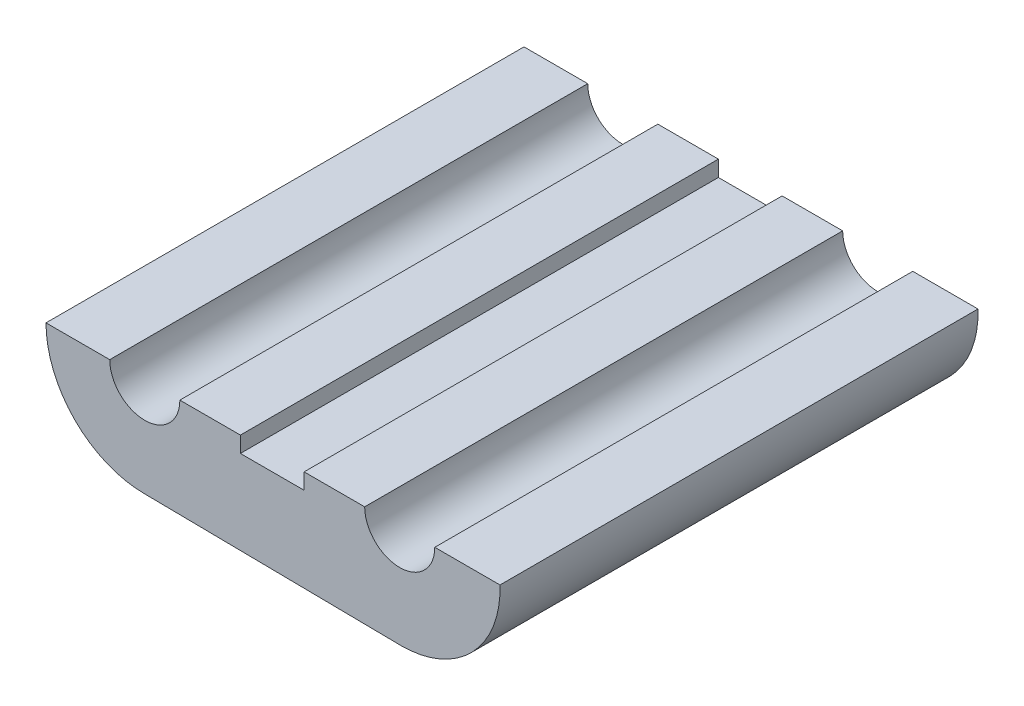
ISO-10303-21;
HEADER;
FILE_DESCRIPTION(('STEP AP214'),'2;1');
FILE_NAME('part.step','',(''),(''),'','','');
FILE_SCHEMA(('AUTOMOTIVE_DESIGN { 1 0 10303 214 1 1 1 1 }'));
ENDSEC;
DATA;
#1=APPLICATION_CONTEXT('core data for automotive mechanical design processes');
#2=APPLICATION_PROTOCOL_DEFINITION('international standard','automotive_design',2000,#1);
#3=PRODUCT_CONTEXT('',#1,'mechanical');
#4=PRODUCT('Part','Part','',(#3));
#5=PRODUCT_RELATED_PRODUCT_CATEGORY('part','',(#4));
#6=PRODUCT_DEFINITION_FORMATION('','',#4);
#7=PRODUCT_DEFINITION_CONTEXT('part definition',#1,'design');
#8=PRODUCT_DEFINITION('design','',#6,#7);
#9=PRODUCT_DEFINITION_SHAPE('','',#8);
#10=(LENGTH_UNIT() NAMED_UNIT(*) SI_UNIT(.MILLI.,.METRE.));
#11=(NAMED_UNIT(*) PLANE_ANGLE_UNIT() SI_UNIT($,.RADIAN.));
#12=(NAMED_UNIT(*) SI_UNIT($,.STERADIAN.) SOLID_ANGLE_UNIT());
#13=UNCERTAINTY_MEASURE_WITH_UNIT(LENGTH_MEASURE(1.E-05),#10,'distance_accuracy_value','');
#14=(GEOMETRIC_REPRESENTATION_CONTEXT(3) GLOBAL_UNCERTAINTY_ASSIGNED_CONTEXT((#13)) GLOBAL_UNIT_ASSIGNED_CONTEXT((#10,
#11,#12)) REPRESENTATION_CONTEXT('',''));
#15=CARTESIAN_POINT('',(0.,0.,0.));
#16=DIRECTION('',(0.,0.,1.));
#17=DIRECTION('',(1.,0.,0.));
#18=AXIS2_PLACEMENT_3D('',#15,#16,#17);
#19=CARTESIAN_POINT('',(0.,0.,0.));
#20=DIRECTION('',(0.,-1.,0.));
#21=DIRECTION('',(0.,0.,-1.));
#22=AXIS2_PLACEMENT_3D('',#19,#20,#21);
#23=PLANE('',#22);
#24=DIRECTION('',(1.,0.,0.));
#25=VECTOR('',#24,1.);
#26=CARTESIAN_POINT('',(0.,0.,0.));
#27=LINE('',#26,#25);
#28=CARTESIAN_POINT('',(1.34744302503624,0.,0.));
#29=VERTEX_POINT('',#28);
#30=CARTESIAN_POINT('',(3.24744302503624,0.,0.));
#31=VERTEX_POINT('',#30);
#32=EDGE_CURVE('E66',#29,#31,#27,.T.);
#33=ORIENTED_EDGE('',*,*,#32,.F.);
#34=DIRECTION('',(0.,0.,1.));
#35=VECTOR('',#34,1.);
#36=CARTESIAN_POINT('',(1.34744302503624,0.,0.));
#37=LINE('',#36,#35);
#38=CARTESIAN_POINT('',(1.34744302503624,0.,15.));
#39=VERTEX_POINT('',#38);
#40=EDGE_CURVE('E134',#29,#39,#37,.T.);
#41=ORIENTED_EDGE('',*,*,#40,.T.);
#42=DIRECTION('',(1.,0.,0.));
#43=VECTOR('',#42,1.);
#44=CARTESIAN_POINT('',(0.,0.,15.));
#45=LINE('',#44,#43);
#46=CARTESIAN_POINT('',(3.24744302503624,0.,15.));
#47=VERTEX_POINT('',#46);
#48=EDGE_CURVE('E253',#39,#47,#45,.T.);
#49=ORIENTED_EDGE('',*,*,#48,.T.);
#50=DIRECTION('',(0.,0.,1.));
#51=VECTOR('',#50,1.);
#52=CARTESIAN_POINT('',(3.24744302503624,0.,0.));
#53=LINE('',#52,#51);
#54=EDGE_CURVE('E152',#31,#47,#53,.T.);
#55=ORIENTED_EDGE('',*,*,#54,.F.);
#56=EDGE_LOOP('',(#33,#41,#49,#55));
#57=FACE_BOUND('',#56,.T.);
#58=ADVANCED_FACE('F42',(#57),#23,.F.);
#59=CARTESIAN_POINT('',(-3.65255697496376,0.,15.));
#60=DIRECTION('',(0.,0.,-1.));
#61=DIRECTION('',(-1.,0.,0.));
#62=AXIS2_PLACEMENT_3D('',#59,#60,#61);
#63=CYLINDRICAL_SURFACE('',#62,1.1);
#64=CARTESIAN_POINT('',(-3.65255697496376,0.,0.));
#65=DIRECTION('',(0.,0.,1.));
#66=DIRECTION('',(1.,0.,0.));
#67=AXIS2_PLACEMENT_3D('',#64,#65,#66);
#68=CIRCLE('',#67,1.1);
#69=CARTESIAN_POINT('',(-4.75255697496376,0.,0.));
#70=VERTEX_POINT('',#69);
#71=CARTESIAN_POINT('',(-2.55255697496376,0.,0.));
#72=VERTEX_POINT('',#71);
#73=EDGE_CURVE('E211',#70,#72,#68,.T.);
#74=ORIENTED_EDGE('',*,*,#73,.F.);
#75=DIRECTION('',(0.,0.,1.));
#76=VECTOR('',#75,1.);
#77=CARTESIAN_POINT('',(-4.75255697496376,0.,0.));
#78=LINE('',#77,#76);
#79=CARTESIAN_POINT('',(-4.75255697496376,0.,15.));
#80=VERTEX_POINT('',#79);
#81=EDGE_CURVE('E167',#70,#80,#78,.T.);
#82=ORIENTED_EDGE('',*,*,#81,.T.);
#83=CARTESIAN_POINT('',(-3.65255697496376,0.,15.));
#84=DIRECTION('',(0.,0.,1.));
#85=DIRECTION('',(1.,0.,0.));
#86=AXIS2_PLACEMENT_3D('',#83,#84,#85);
#87=CIRCLE('',#86,1.1);
#88=CARTESIAN_POINT('',(-2.55255697496376,0.,15.));
#89=VERTEX_POINT('',#88);
#90=EDGE_CURVE('E193',#80,#89,#87,.T.);
#91=ORIENTED_EDGE('',*,*,#90,.T.);
#92=DIRECTION('',(0.,0.,1.));
#93=VECTOR('',#92,1.);
#94=CARTESIAN_POINT('',(-2.55255697496376,0.,0.));
#95=LINE('',#94,#93);
#96=EDGE_CURVE('E171',#72,#89,#95,.T.);
#97=ORIENTED_EDGE('',*,*,#96,.F.);
#98=EDGE_LOOP('',(#74,#82,#91,#97));
#99=FACE_BOUND('',#98,.T.);
#100=ADVANCED_FACE('F281',(#99),#63,.F.);
#101=CARTESIAN_POINT('',(-3.65255697496376,0.,15.));
#102=DIRECTION('',(0.,0.,-1.));
#103=DIRECTION('',(-1.,0.,0.));
#104=AXIS2_PLACEMENT_3D('',#101,#102,#103);
#105=CYLINDRICAL_SURFACE('',#104,3.1);
#106=DIRECTION('',(0.,0.,1.));
#107=VECTOR('',#106,1.);
#108=CARTESIAN_POINT('',(-6.75255697496376,0.,0.));
#109=LINE('',#108,#107);
#110=CARTESIAN_POINT('',(-6.75255697496376,0.,0.));
#111=VERTEX_POINT('',#110);
#112=CARTESIAN_POINT('',(-6.75255697496376,0.,15.));
#113=VERTEX_POINT('',#112);
#114=EDGE_CURVE('E205',#111,#113,#109,.T.);
#115=ORIENTED_EDGE('',*,*,#114,.F.);
#116=CARTESIAN_POINT('',(-3.65255697496376,0.,0.));
#117=DIRECTION('',(0.,0.,1.));
#118=DIRECTION('',(1.,0.,0.));
#119=AXIS2_PLACEMENT_3D('',#116,#117,#118);
#120=CIRCLE('',#119,3.1);
#121=CARTESIAN_POINT('',(-3.65255697496372,-3.1,0.));
#122=VERTEX_POINT('',#121);
#123=EDGE_CURVE('E208',#111,#122,#120,.T.);
#124=ORIENTED_EDGE('',*,*,#123,.T.);
#125=DIRECTION('',(0.,0.,-1.));
#126=VECTOR('',#125,1.);
#127=CARTESIAN_POINT('',(-3.65255697496372,-3.1,15.));
#128=LINE('',#127,#126);
#129=CARTESIAN_POINT('',(-3.65255697496372,-3.1,15.));
#130=VERTEX_POINT('',#129);
#131=EDGE_CURVE('E51',#130,#122,#128,.T.);
#132=ORIENTED_EDGE('',*,*,#131,.F.);
#133=CARTESIAN_POINT('',(-3.65255697496376,0.,15.));
#134=DIRECTION('',(0.,0.,1.));
#135=DIRECTION('',(1.,0.,0.));
#136=AXIS2_PLACEMENT_3D('',#133,#134,#135);
#137=CIRCLE('',#136,3.1);
#138=EDGE_CURVE('E190',#113,#130,#137,.T.);
#139=ORIENTED_EDGE('',*,*,#138,.F.);
#140=EDGE_LOOP('',(#115,#124,#132,#139));
#141=FACE_BOUND('',#140,.T.);
#142=ADVANCED_FACE('F237',(#141),#105,.T.);
#143=CARTESIAN_POINT('',(0.,0.,15.));
#144=DIRECTION('',(0.,0.,1.));
#145=DIRECTION('',(1.,0.,0.));
#146=AXIS2_PLACEMENT_3D('',#143,#144,#145);
#147=PLANE('',#146);
#148=DIRECTION('',(0.,1.,0.));
#149=VECTOR('',#148,1.);
#150=CARTESIAN_POINT('',(1.34744302503624,0.,15.));
#151=LINE('',#150,#149);
#152=CARTESIAN_POINT('',(1.34744302503624,-0.5,15.));
#153=VERTEX_POINT('',#152);
#154=EDGE_CURVE('E139',#153,#39,#151,.T.);
#155=ORIENTED_EDGE('',*,*,#154,.F.);
#156=DIRECTION('',(1.,0.,0.));
#157=VECTOR('',#156,1.);
#158=CARTESIAN_POINT('',(-0.652556974963756,-0.5,15.));
#159=LINE('',#158,#157);
#160=CARTESIAN_POINT('',(-0.652556974963756,-0.5,15.));
#161=VERTEX_POINT('',#160);
#162=EDGE_CURVE('E149',#161,#153,#159,.T.);
#163=ORIENTED_EDGE('',*,*,#162,.F.);
#164=DIRECTION('',(0.,-1.,0.));
#165=VECTOR('',#164,1.);
#166=CARTESIAN_POINT('',(-0.652556974963756,0.,15.));
#167=LINE('',#166,#165);
#168=CARTESIAN_POINT('',(-0.652556974963756,0.,15.));
#169=VERTEX_POINT('',#168);
#170=EDGE_CURVE('E274',#169,#161,#167,.T.);
#171=ORIENTED_EDGE('',*,*,#170,.F.);
#172=EDGE_CURVE('E245',#89,#169,#45,.T.);
#173=ORIENTED_EDGE('',*,*,#172,.F.);
#174=ORIENTED_EDGE('',*,*,#90,.F.);
#175=DIRECTION('',(-1.,0.,0.));
#176=VECTOR('',#175,1.);
#177=CARTESIAN_POINT('',(0.,0.,15.));
#178=LINE('',#177,#176);
#179=EDGE_CURVE('E235',#80,#113,#178,.T.);
#180=ORIENTED_EDGE('',*,*,#179,.T.);
#181=ORIENTED_EDGE('',*,*,#138,.T.);
#182=DIRECTION('',(0.99991994625897,-0.0126531052891458,0.));
#183=VECTOR('',#182,1.);
#184=CARTESIAN_POINT('',(-0.0398062646108273,-3.14571617487236,15.));
#185=LINE('',#184,#183);
#186=CARTESIAN_POINT('',(4.39599344569609,-3.20184730915572,15.));
#187=VERTEX_POINT('',#186);
#188=EDGE_CURVE('E181',#130,#187,#185,.T.);
#189=ORIENTED_EDGE('',*,*,#188,.T.);
#190=CARTESIAN_POINT('',(4.39599344569605,-0.101847309155721,15.));
#191=DIRECTION('',(0.,0.,1.));
#192=DIRECTION('',(1.,0.,0.));
#193=AXIS2_PLACEMENT_3D('',#190,#191,#192);
#194=CIRCLE('',#193,3.1);
#195=CARTESIAN_POINT('',(7.49431994973299,0.,15.));
#196=VERTEX_POINT('',#195);
#197=EDGE_CURVE('E185',#187,#196,#194,.T.);
#198=ORIENTED_EDGE('',*,*,#197,.T.);
#199=CARTESIAN_POINT('',(5.44744302503624,0.,15.));
#200=VERTEX_POINT('',#199);
#201=EDGE_CURVE('E162',#200,#196,#45,.T.);
#202=ORIENTED_EDGE('',*,*,#201,.F.);
#203=CARTESIAN_POINT('',(4.34744302503624,0.,15.));
#204=DIRECTION('',(0.,0.,1.));
#205=DIRECTION('',(1.,0.,0.));
#206=AXIS2_PLACEMENT_3D('',#203,#204,#205);
#207=CIRCLE('',#206,1.1);
#208=EDGE_CURVE('E196',#47,#200,#207,.T.);
#209=ORIENTED_EDGE('',*,*,#208,.F.);
#210=ORIENTED_EDGE('',*,*,#48,.F.);
#211=EDGE_LOOP('',(#155,#163,#171,#173,#174,#180,#181,#189,#198,#202,#209,#210));
#212=FACE_BOUND('',#211,.T.);
#213=ADVANCED_FACE('F233',(#212),#147,.T.);
#214=CARTESIAN_POINT('',(0.,0.,0.));
#215=DIRECTION('',(0.,0.,1.));
#216=DIRECTION('',(1.,0.,0.));
#217=AXIS2_PLACEMENT_3D('',#214,#215,#216);
#218=PLANE('',#217);
#219=DIRECTION('',(1.,0.,0.));
#220=VECTOR('',#219,1.);
#221=CARTESIAN_POINT('',(-0.652556974963756,-0.5,0.));
#222=LINE('',#221,#220);
#223=CARTESIAN_POINT('',(-0.652556974963756,-0.5,0.));
#224=VERTEX_POINT('',#223);
#225=CARTESIAN_POINT('',(1.34744302503624,-0.5,0.));
#226=VERTEX_POINT('',#225);
#227=EDGE_CURVE('E144',#224,#226,#222,.T.);
#228=ORIENTED_EDGE('',*,*,#227,.T.);
#229=DIRECTION('',(0.,1.,0.));
#230=VECTOR('',#229,1.);
#231=CARTESIAN_POINT('',(1.34744302503624,0.,0.));
#232=LINE('',#231,#230);
#233=EDGE_CURVE('E136',#226,#29,#232,.T.);
#234=ORIENTED_EDGE('',*,*,#233,.T.);
#235=ORIENTED_EDGE('',*,*,#32,.T.);
#236=CARTESIAN_POINT('',(4.34744302503624,0.,0.));
#237=DIRECTION('',(0.,0.,1.));
#238=DIRECTION('',(1.,0.,0.));
#239=AXIS2_PLACEMENT_3D('',#236,#237,#238);
#240=CIRCLE('',#239,1.1);
#241=CARTESIAN_POINT('',(5.44744302503624,0.,0.));
#242=VERTEX_POINT('',#241);
#243=EDGE_CURVE('E186',#31,#242,#240,.T.);
#244=ORIENTED_EDGE('',*,*,#243,.T.);
#245=CARTESIAN_POINT('',(7.49431994973299,0.,0.));
#246=VERTEX_POINT('',#245);
#247=EDGE_CURVE('E158',#242,#246,#27,.T.);
#248=ORIENTED_EDGE('',*,*,#247,.T.);
#249=CARTESIAN_POINT('',(4.39599344569605,-0.101847309155721,0.));
#250=DIRECTION('',(0.,0.,1.));
#251=DIRECTION('',(1.,0.,0.));
#252=AXIS2_PLACEMENT_3D('',#249,#250,#251);
#253=CIRCLE('',#252,3.1);
#254=CARTESIAN_POINT('',(4.39599344569609,-3.20184730915572,0.));
#255=VERTEX_POINT('',#254);
#256=EDGE_CURVE('E204',#255,#246,#253,.T.);
#257=ORIENTED_EDGE('',*,*,#256,.F.);
#258=DIRECTION('',(0.99991994625897,-0.0126531052891458,0.));
#259=VECTOR('',#258,1.);
#260=CARTESIAN_POINT('',(-0.0398062646108273,-3.14571617487236,0.));
#261=LINE('',#260,#259);
#262=EDGE_CURVE('E200',#122,#255,#261,.T.);
#263=ORIENTED_EDGE('',*,*,#262,.F.);
#264=ORIENTED_EDGE('',*,*,#123,.F.);
#265=DIRECTION('',(-1.,0.,0.));
#266=VECTOR('',#265,1.);
#267=CARTESIAN_POINT('',(0.,0.,0.));
#268=LINE('',#267,#266);
#269=EDGE_CURVE('E156',#70,#111,#268,.T.);
#270=ORIENTED_EDGE('',*,*,#269,.F.);
#271=ORIENTED_EDGE('',*,*,#73,.T.);
#272=CARTESIAN_POINT('',(-0.652556974963756,0.,0.));
#273=VERTEX_POINT('',#272);
#274=EDGE_CURVE('E155',#72,#273,#27,.T.);
#275=ORIENTED_EDGE('',*,*,#274,.T.);
#276=DIRECTION('',(0.,-1.,0.));
#277=VECTOR('',#276,1.);
#278=CARTESIAN_POINT('',(-0.652556974963756,0.,0.));
#279=LINE('',#278,#277);
#280=EDGE_CURVE('E58',#273,#224,#279,.T.);
#281=ORIENTED_EDGE('',*,*,#280,.T.);
#282=EDGE_LOOP('',(#228,#234,#235,#244,#248,#257,#263,#264,#270,#271,#275,#281));
#283=FACE_BOUND('',#282,.T.);
#284=ADVANCED_FACE('F146',(#283),#218,.F.);
#285=CARTESIAN_POINT('',(-0.0398062646108273,-3.14571617487236,15.));
#286=DIRECTION('',(0.0126531052891458,0.99991994625897,0.));
#287=DIRECTION('',(-0.99991994625897,0.0126531052891458,0.));
#288=AXIS2_PLACEMENT_3D('',#285,#286,#287);
#289=PLANE('',#288);
#290=ORIENTED_EDGE('',*,*,#262,.T.);
#291=DIRECTION('',(0.,0.,-1.));
#292=VECTOR('',#291,1.);
#293=CARTESIAN_POINT('',(4.39599344569609,-3.20184730915572,15.));
#294=LINE('',#293,#292);
#295=EDGE_CURVE('E11',#187,#255,#294,.T.);
#296=ORIENTED_EDGE('',*,*,#295,.F.);
#297=ORIENTED_EDGE('',*,*,#188,.F.);
#298=ORIENTED_EDGE('',*,*,#131,.T.);
#299=EDGE_LOOP('',(#290,#296,#297,#298));
#300=FACE_BOUND('',#299,.T.);
#301=ADVANCED_FACE('F44',(#300),#289,.F.);
#302=CARTESIAN_POINT('',(4.39599344569605,-0.101847309155721,15.));
#303=DIRECTION('',(0.,0.,-1.));
#304=DIRECTION('',(-1.,0.,0.));
#305=AXIS2_PLACEMENT_3D('',#302,#303,#304);
#306=CYLINDRICAL_SURFACE('',#305,3.1);
#307=ORIENTED_EDGE('',*,*,#256,.T.);
#308=DIRECTION('',(0.,0.,1.));
#309=VECTOR('',#308,1.);
#310=CARTESIAN_POINT('',(7.49431994973299,0.,0.));
#311=LINE('',#310,#309);
#312=EDGE_CURVE('E230',#246,#196,#311,.T.);
#313=ORIENTED_EDGE('',*,*,#312,.T.);
#314=ORIENTED_EDGE('',*,*,#197,.F.);
#315=ORIENTED_EDGE('',*,*,#295,.T.);
#316=EDGE_LOOP('',(#307,#313,#314,#315));
#317=FACE_BOUND('',#316,.T.);
#318=ADVANCED_FACE('F229',(#317),#306,.T.);
#319=CARTESIAN_POINT('',(4.34744302503624,0.,15.));
#320=DIRECTION('',(0.,0.,-1.));
#321=DIRECTION('',(-1.,0.,0.));
#322=AXIS2_PLACEMENT_3D('',#319,#320,#321);
#323=CYLINDRICAL_SURFACE('',#322,1.1);
#324=DIRECTION('',(0.,0.,1.));
#325=VECTOR('',#324,1.);
#326=CARTESIAN_POINT('',(5.44744302503624,0.,0.));
#327=LINE('',#326,#325);
#328=EDGE_CURVE('E242',#242,#200,#327,.T.);
#329=ORIENTED_EDGE('',*,*,#328,.F.);
#330=ORIENTED_EDGE('',*,*,#243,.F.);
#331=ORIENTED_EDGE('',*,*,#54,.T.);
#332=ORIENTED_EDGE('',*,*,#208,.T.);
#333=EDGE_LOOP('',(#329,#330,#331,#332));
#334=FACE_BOUND('',#333,.T.);
#335=ADVANCED_FACE('F252',(#334),#323,.F.);
#336=ORIENTED_EDGE('',*,*,#172,.T.);
#337=DIRECTION('',(0.,0.,1.));
#338=VECTOR('',#337,1.);
#339=CARTESIAN_POINT('',(-0.652556974963756,0.,0.));
#340=LINE('',#339,#338);
#341=EDGE_CURVE('E143',#273,#169,#340,.T.);
#342=ORIENTED_EDGE('',*,*,#341,.F.);
#343=ORIENTED_EDGE('',*,*,#274,.F.);
#344=ORIENTED_EDGE('',*,*,#96,.T.);
#345=EDGE_LOOP('',(#336,#342,#343,#344));
#346=FACE_BOUND('',#345,.T.);
#347=ADVANCED_FACE('F279',(#346),#23,.F.);
#348=ORIENTED_EDGE('',*,*,#201,.T.);
#349=ORIENTED_EDGE('',*,*,#312,.F.);
#350=ORIENTED_EDGE('',*,*,#247,.F.);
#351=ORIENTED_EDGE('',*,*,#328,.T.);
#352=EDGE_LOOP('',(#348,#349,#350,#351));
#353=FACE_BOUND('',#352,.T.);
#354=ADVANCED_FACE('F284',(#353),#23,.F.);
#355=CARTESIAN_POINT('',(0.,0.,0.));
#356=DIRECTION('',(0.,1.,0.));
#357=DIRECTION('',(0.,0.,1.));
#358=AXIS2_PLACEMENT_3D('',#355,#356,#357);
#359=PLANE('',#358);
#360=ORIENTED_EDGE('',*,*,#179,.F.);
#361=ORIENTED_EDGE('',*,*,#81,.F.);
#362=ORIENTED_EDGE('',*,*,#269,.T.);
#363=ORIENTED_EDGE('',*,*,#114,.T.);
#364=EDGE_LOOP('',(#360,#361,#362,#363));
#365=FACE_BOUND('',#364,.T.);
#366=ADVANCED_FACE('F282',(#365),#359,.T.);
#367=CARTESIAN_POINT('',(1.34744302503624,0.,0.));
#368=DIRECTION('',(1.,0.,0.));
#369=DIRECTION('',(0.,0.,-1.));
#370=AXIS2_PLACEMENT_3D('',#367,#368,#369);
#371=PLANE('',#370);
#372=ORIENTED_EDGE('',*,*,#154,.T.);
#373=ORIENTED_EDGE('',*,*,#40,.F.);
#374=ORIENTED_EDGE('',*,*,#233,.F.);
#375=DIRECTION('',(0.,0.,1.));
#376=VECTOR('',#375,1.);
#377=CARTESIAN_POINT('',(1.34744302503624,-0.5,0.));
#378=LINE('',#377,#376);
#379=EDGE_CURVE('E260',#226,#153,#378,.T.);
#380=ORIENTED_EDGE('',*,*,#379,.T.);
#381=EDGE_LOOP('',(#372,#373,#374,#380));
#382=FACE_BOUND('',#381,.T.);
#383=ADVANCED_FACE('F135',(#382),#371,.F.);
#384=CARTESIAN_POINT('',(-0.652556974963756,-0.5,0.));
#385=DIRECTION('',(0.,-1.,0.));
#386=DIRECTION('',(0.,0.,-1.));
#387=AXIS2_PLACEMENT_3D('',#384,#385,#386);
#388=PLANE('',#387);
#389=ORIENTED_EDGE('',*,*,#162,.T.);
#390=ORIENTED_EDGE('',*,*,#379,.F.);
#391=ORIENTED_EDGE('',*,*,#227,.F.);
#392=DIRECTION('',(0.,0.,1.));
#393=VECTOR('',#392,1.);
#394=CARTESIAN_POINT('',(-0.652556974963756,-0.5,0.));
#395=LINE('',#394,#393);
#396=EDGE_CURVE('E262',#224,#161,#395,.T.);
#397=ORIENTED_EDGE('',*,*,#396,.T.);
#398=EDGE_LOOP('',(#389,#390,#391,#397));
#399=FACE_BOUND('',#398,.T.);
#400=ADVANCED_FACE('F291',(#399),#388,.F.);
#401=CARTESIAN_POINT('',(-0.652556974963756,0.,0.));
#402=DIRECTION('',(-1.,0.,0.));
#403=DIRECTION('',(0.,0.,1.));
#404=AXIS2_PLACEMENT_3D('',#401,#402,#403);
#405=PLANE('',#404);
#406=ORIENTED_EDGE('',*,*,#170,.T.);
#407=ORIENTED_EDGE('',*,*,#396,.F.);
#408=ORIENTED_EDGE('',*,*,#280,.F.);
#409=ORIENTED_EDGE('',*,*,#341,.T.);
#410=EDGE_LOOP('',(#406,#407,#408,#409));
#411=FACE_BOUND('',#410,.T.);
#412=ADVANCED_FACE('F273',(#411),#405,.F.);
#413=CLOSED_SHELL('',(#58,#100,#142,#213,#284,#301,#318,#335,#347,#354,#366,#383,#400,#412));
#414=MANIFOLD_SOLID_BREP('B2',#413);
#415=ADVANCED_BREP_SHAPE_REPRESENTATION('',(#18,#414),#14);
#416=SHAPE_DEFINITION_REPRESENTATION(#9,#415);
ENDSEC;
END-ISO-10303-21;
